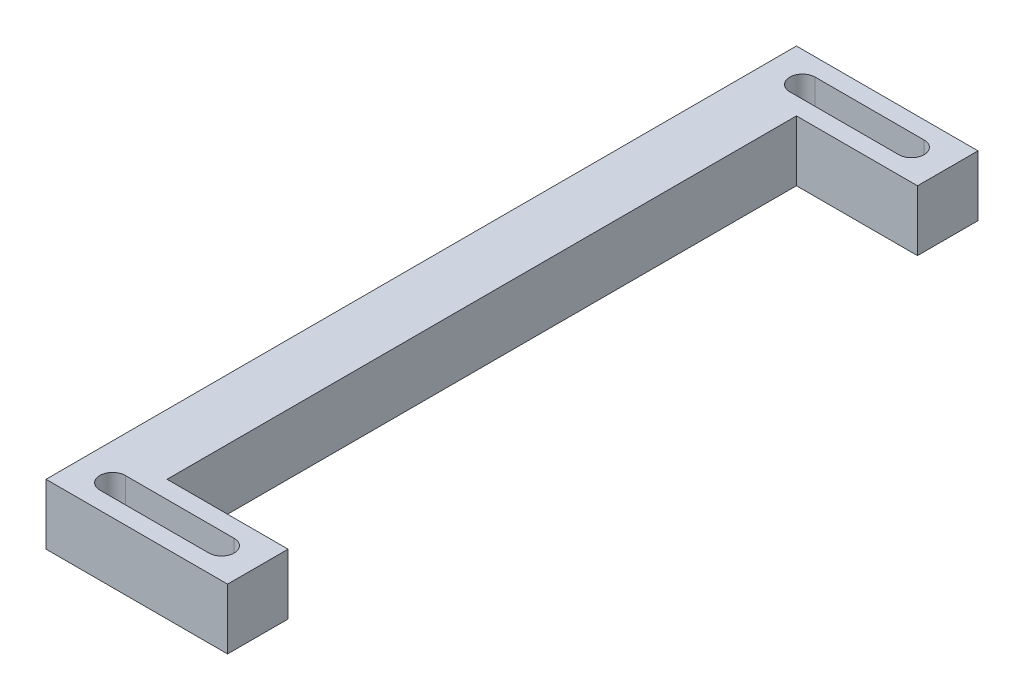
ISO-10303-21;
HEADER;
FILE_DESCRIPTION(('STEP AP214'),'2;1');
FILE_NAME('part.step','',(''),(''),'','','');
FILE_SCHEMA(('AUTOMOTIVE_DESIGN { 1 0 10303 214 1 1 1 1 }'));
ENDSEC;
DATA;
#1=APPLICATION_CONTEXT('core data for automotive mechanical design processes');
#2=APPLICATION_PROTOCOL_DEFINITION('international standard','automotive_design',2000,#1);
#3=PRODUCT_CONTEXT('',#1,'mechanical');
#4=PRODUCT('Part','Part','',(#3));
#5=PRODUCT_RELATED_PRODUCT_CATEGORY('part','',(#4));
#6=PRODUCT_DEFINITION_FORMATION('','',#4);
#7=PRODUCT_DEFINITION_CONTEXT('part definition',#1,'design');
#8=PRODUCT_DEFINITION('design','',#6,#7);
#9=PRODUCT_DEFINITION_SHAPE('','',#8);
#10=(LENGTH_UNIT() NAMED_UNIT(*) SI_UNIT(.MILLI.,.METRE.));
#11=(NAMED_UNIT(*) PLANE_ANGLE_UNIT() SI_UNIT($,.RADIAN.));
#12=(NAMED_UNIT(*) SI_UNIT($,.STERADIAN.) SOLID_ANGLE_UNIT());
#13=UNCERTAINTY_MEASURE_WITH_UNIT(LENGTH_MEASURE(1.E-05),#10,'distance_accuracy_value','');
#14=(GEOMETRIC_REPRESENTATION_CONTEXT(3) GLOBAL_UNCERTAINTY_ASSIGNED_CONTEXT((#13)) GLOBAL_UNIT_ASSIGNED_CONTEXT((#10,
#11,#12)) REPRESENTATION_CONTEXT('',''));
#15=CARTESIAN_POINT('',(0.,0.,0.));
#16=DIRECTION('',(0.,0.,1.));
#17=DIRECTION('',(1.,0.,0.));
#18=AXIS2_PLACEMENT_3D('',#15,#16,#17);
#19=CARTESIAN_POINT('',(0.,10.,0.));
#20=DIRECTION('',(0.,1.,0.));
#21=DIRECTION('',(0.,0.,1.));
#22=AXIS2_PLACEMENT_3D('',#19,#20,#21);
#23=PLANE('',#22);
#24=DIRECTION('',(1.,0.,0.));
#25=VECTOR('',#24,1.);
#26=CARTESIAN_POINT('',(-77.,10.,-52.));
#27=LINE('',#26,#25);
#28=CARTESIAN_POINT('',(-77.,10.,-52.));
#29=VERTEX_POINT('',#28);
#30=CARTESIAN_POINT('',(-57.,10.,-52.));
#31=VERTEX_POINT('',#30);
#32=EDGE_CURVE('E212',#29,#31,#27,.T.);
#33=ORIENTED_EDGE('',*,*,#32,.T.);
#34=DIRECTION('',(0.,0.,-1.));
#35=VECTOR('',#34,1.);
#36=CARTESIAN_POINT('',(-57.,10.,-52.));
#37=LINE('',#36,#35);
#38=CARTESIAN_POINT('',(-57.,10.,-62.));
#39=VERTEX_POINT('',#38);
#40=EDGE_CURVE('E215',#31,#39,#37,.T.);
#41=ORIENTED_EDGE('',*,*,#40,.T.);
#42=DIRECTION('',(-1.,0.,0.));
#43=VECTOR('',#42,1.);
#44=CARTESIAN_POINT('',(-57.,10.,-62.));
#45=LINE('',#44,#43);
#46=CARTESIAN_POINT('',(-87.,10.,-62.));
#47=VERTEX_POINT('',#46);
#48=EDGE_CURVE('E218',#39,#47,#45,.T.);
#49=ORIENTED_EDGE('',*,*,#48,.T.);
#50=DIRECTION('',(0.,0.,1.));
#51=VECTOR('',#50,1.);
#52=CARTESIAN_POINT('',(-87.,10.,-62.));
#53=LINE('',#52,#51);
#54=CARTESIAN_POINT('',(-87.,10.,62.));
#55=VERTEX_POINT('',#54);
#56=EDGE_CURVE('E220',#47,#55,#53,.T.);
#57=ORIENTED_EDGE('',*,*,#56,.T.);
#58=DIRECTION('',(1.,0.,0.));
#59=VECTOR('',#58,1.);
#60=CARTESIAN_POINT('',(-87.,10.,62.));
#61=LINE('',#60,#59);
#62=CARTESIAN_POINT('',(-57.,10.,62.));
#63=VERTEX_POINT('',#62);
#64=EDGE_CURVE('E222',#55,#63,#61,.T.);
#65=ORIENTED_EDGE('',*,*,#64,.T.);
#66=DIRECTION('',(0.,0.,-1.));
#67=VECTOR('',#66,1.);
#68=CARTESIAN_POINT('',(-57.,10.,62.));
#69=LINE('',#68,#67);
#70=CARTESIAN_POINT('',(-57.,10.,52.));
#71=VERTEX_POINT('',#70);
#72=EDGE_CURVE('E224',#63,#71,#69,.T.);
#73=ORIENTED_EDGE('',*,*,#72,.T.);
#74=DIRECTION('',(-1.,0.,0.));
#75=VECTOR('',#74,1.);
#76=CARTESIAN_POINT('',(-57.,10.,52.));
#77=LINE('',#76,#75);
#78=CARTESIAN_POINT('',(-77.,10.,52.));
#79=VERTEX_POINT('',#78);
#80=EDGE_CURVE('E226',#71,#79,#77,.T.);
#81=ORIENTED_EDGE('',*,*,#80,.T.);
#82=DIRECTION('',(0.,0.,-1.));
#83=VECTOR('',#82,1.);
#84=CARTESIAN_POINT('',(-77.,10.,52.));
#85=LINE('',#84,#83);
#86=EDGE_CURVE('E228',#79,#29,#85,.T.);
#87=ORIENTED_EDGE('',*,*,#86,.T.);
#88=EDGE_LOOP('',(#33,#41,#49,#57,#65,#73,#81,#87));
#89=FACE_BOUND('',#88,.T.);
#90=DIRECTION('',(1.,0.,0.));
#91=VECTOR('',#90,1.);
#92=CARTESIAN_POINT('',(-81.,10.,-54.9));
#93=LINE('',#92,#91);
#94=CARTESIAN_POINT('',(-81.,10.,-54.9));
#95=VERTEX_POINT('',#94);
#96=CARTESIAN_POINT('',(-63.0000000000001,10.,-54.9));
#97=VERTEX_POINT('',#96);
#98=EDGE_CURVE('E183',#95,#97,#93,.T.);
#99=ORIENTED_EDGE('',*,*,#98,.F.);
#100=CARTESIAN_POINT('',(-81.,10.,-57.));
#101=DIRECTION('',(0.,1.,0.));
#102=DIRECTION('',(0.,0.,1.));
#103=AXIS2_PLACEMENT_3D('',#100,#101,#102);
#104=CIRCLE('',#103,2.1);
#105=CARTESIAN_POINT('',(-81.,10.,-59.1));
#106=VERTEX_POINT('',#105);
#107=EDGE_CURVE('E181',#106,#95,#104,.T.);
#108=ORIENTED_EDGE('',*,*,#107,.F.);
#109=DIRECTION('',(-1.,0.,0.));
#110=VECTOR('',#109,1.);
#111=CARTESIAN_POINT('',(-81.,10.,-59.1));
#112=LINE('',#111,#110);
#113=CARTESIAN_POINT('',(-63.0000000000001,10.,-59.1));
#114=VERTEX_POINT('',#113);
#115=EDGE_CURVE('E189',#114,#106,#112,.T.);
#116=ORIENTED_EDGE('',*,*,#115,.F.);
#117=CARTESIAN_POINT('',(-63.0000000000001,10.,-57.));
#118=DIRECTION('',(0.,1.,0.));
#119=DIRECTION('',(0.,0.,1.));
#120=AXIS2_PLACEMENT_3D('',#117,#118,#119);
#121=CIRCLE('',#120,2.1);
#122=EDGE_CURVE('E186',#97,#114,#121,.T.);
#123=ORIENTED_EDGE('',*,*,#122,.F.);
#124=EDGE_LOOP('',(#99,#108,#116,#123));
#125=FACE_BOUND('',#124,.T.);
#126=DIRECTION('',(1.,0.,0.));
#127=VECTOR('',#126,1.);
#128=CARTESIAN_POINT('',(-81.,10.,59.1));
#129=LINE('',#128,#127);
#130=CARTESIAN_POINT('',(-81.,10.,59.1));
#131=VERTEX_POINT('',#130);
#132=CARTESIAN_POINT('',(-63.,10.,59.1));
#133=VERTEX_POINT('',#132);
#134=EDGE_CURVE('E153',#131,#133,#129,.T.);
#135=ORIENTED_EDGE('',*,*,#134,.F.);
#136=CARTESIAN_POINT('',(-81.,10.,57.));
#137=DIRECTION('',(0.,1.,0.));
#138=DIRECTION('',(0.,0.,-1.));
#139=AXIS2_PLACEMENT_3D('',#136,#137,#138);
#140=CIRCLE('',#139,2.1);
#141=CARTESIAN_POINT('',(-81.,10.,54.9));
#142=VERTEX_POINT('',#141);
#143=EDGE_CURVE('E145',#142,#131,#140,.T.);
#144=ORIENTED_EDGE('',*,*,#143,.F.);
#145=DIRECTION('',(-1.,0.,0.));
#146=VECTOR('',#145,1.);
#147=CARTESIAN_POINT('',(-81.,10.,54.9));
#148=LINE('',#147,#146);
#149=CARTESIAN_POINT('',(-63.0000000000001,10.,54.9));
#150=VERTEX_POINT('',#149);
#151=EDGE_CURVE('E167',#150,#142,#148,.T.);
#152=ORIENTED_EDGE('',*,*,#151,.F.);
#153=CARTESIAN_POINT('',(-63.,10.,57.));
#154=DIRECTION('',(0.,1.,0.));
#155=DIRECTION('',(0.,0.,-1.));
#156=AXIS2_PLACEMENT_3D('',#153,#154,#155);
#157=CIRCLE('',#156,2.1);
#158=EDGE_CURVE('E165',#133,#150,#157,.T.);
#159=ORIENTED_EDGE('',*,*,#158,.F.);
#160=EDGE_LOOP('',(#135,#144,#152,#159));
#161=FACE_BOUND('',#160,.T.);
#162=ADVANCED_FACE('F32',(#89,#125,#161),#23,.T.);
#163=CARTESIAN_POINT('',(0.,0.,0.));
#164=DIRECTION('',(0.,1.,0.));
#165=DIRECTION('',(0.,0.,1.));
#166=AXIS2_PLACEMENT_3D('',#163,#164,#165);
#167=PLANE('',#166);
#168=CARTESIAN_POINT('',(-81.,0.,-57.));
#169=DIRECTION('',(0.,1.,0.));
#170=DIRECTION('',(0.,0.,1.));
#171=AXIS2_PLACEMENT_3D('',#168,#169,#170);
#172=CIRCLE('',#171,2.1);
#173=CARTESIAN_POINT('',(-81.,0.,-59.1));
#174=VERTEX_POINT('',#173);
#175=CARTESIAN_POINT('',(-81.,0.,-54.9));
#176=VERTEX_POINT('',#175);
#177=EDGE_CURVE('E161',#174,#176,#172,.T.);
#178=ORIENTED_EDGE('',*,*,#177,.T.);
#179=DIRECTION('',(1.,0.,0.));
#180=VECTOR('',#179,1.);
#181=CARTESIAN_POINT('',(-81.,0.,-54.9));
#182=LINE('',#181,#180);
#183=CARTESIAN_POINT('',(-63.0000000000001,0.,-54.9));
#184=VERTEX_POINT('',#183);
#185=EDGE_CURVE('E194',#176,#184,#182,.T.);
#186=ORIENTED_EDGE('',*,*,#185,.T.);
#187=CARTESIAN_POINT('',(-63.0000000000001,0.,-57.));
#188=DIRECTION('',(0.,1.,0.));
#189=DIRECTION('',(0.,0.,1.));
#190=AXIS2_PLACEMENT_3D('',#187,#188,#189);
#191=CIRCLE('',#190,2.1);
#192=CARTESIAN_POINT('',(-63.0000000000001,0.,-59.1));
#193=VERTEX_POINT('',#192);
#194=EDGE_CURVE('E197',#184,#193,#191,.T.);
#195=ORIENTED_EDGE('',*,*,#194,.T.);
#196=DIRECTION('',(-1.,0.,0.));
#197=VECTOR('',#196,1.);
#198=CARTESIAN_POINT('',(-81.,0.,-59.1));
#199=LINE('',#198,#197);
#200=EDGE_CURVE('E184',#193,#174,#199,.T.);
#201=ORIENTED_EDGE('',*,*,#200,.T.);
#202=EDGE_LOOP('',(#178,#186,#195,#201));
#203=FACE_BOUND('',#202,.T.);
#204=DIRECTION('',(1.,0.,0.));
#205=VECTOR('',#204,1.);
#206=CARTESIAN_POINT('',(-77.,0.,-52.));
#207=LINE('',#206,#205);
#208=CARTESIAN_POINT('',(-77.,0.,-52.));
#209=VERTEX_POINT('',#208);
#210=CARTESIAN_POINT('',(-57.,0.,-52.));
#211=VERTEX_POINT('',#210);
#212=EDGE_CURVE('E211',#209,#211,#207,.T.);
#213=ORIENTED_EDGE('',*,*,#212,.F.);
#214=DIRECTION('',(0.,0.,-1.));
#215=VECTOR('',#214,1.);
#216=CARTESIAN_POINT('',(-77.,0.,52.));
#217=LINE('',#216,#215);
#218=CARTESIAN_POINT('',(-77.,0.,52.));
#219=VERTEX_POINT('',#218);
#220=EDGE_CURVE('E216',#219,#209,#217,.T.);
#221=ORIENTED_EDGE('',*,*,#220,.F.);
#222=DIRECTION('',(-1.,0.,0.));
#223=VECTOR('',#222,1.);
#224=CARTESIAN_POINT('',(-57.,0.,52.));
#225=LINE('',#224,#223);
#226=CARTESIAN_POINT('',(-57.,0.,52.));
#227=VERTEX_POINT('',#226);
#228=EDGE_CURVE('E243',#227,#219,#225,.T.);
#229=ORIENTED_EDGE('',*,*,#228,.F.);
#230=DIRECTION('',(0.,0.,-1.));
#231=VECTOR('',#230,1.);
#232=CARTESIAN_POINT('',(-57.,0.,62.));
#233=LINE('',#232,#231);
#234=CARTESIAN_POINT('',(-57.,0.,62.));
#235=VERTEX_POINT('',#234);
#236=EDGE_CURVE('E241',#235,#227,#233,.T.);
#237=ORIENTED_EDGE('',*,*,#236,.F.);
#238=DIRECTION('',(1.,0.,0.));
#239=VECTOR('',#238,1.);
#240=CARTESIAN_POINT('',(-87.,0.,62.));
#241=LINE('',#240,#239);
#242=CARTESIAN_POINT('',(-87.,0.,62.));
#243=VERTEX_POINT('',#242);
#244=EDGE_CURVE('E239',#243,#235,#241,.T.);
#245=ORIENTED_EDGE('',*,*,#244,.F.);
#246=DIRECTION('',(0.,0.,1.));
#247=VECTOR('',#246,1.);
#248=CARTESIAN_POINT('',(-87.,0.,-62.));
#249=LINE('',#248,#247);
#250=CARTESIAN_POINT('',(-87.,0.,-62.));
#251=VERTEX_POINT('',#250);
#252=EDGE_CURVE('E237',#251,#243,#249,.T.);
#253=ORIENTED_EDGE('',*,*,#252,.F.);
#254=DIRECTION('',(-1.,0.,0.));
#255=VECTOR('',#254,1.);
#256=CARTESIAN_POINT('',(-57.,0.,-62.));
#257=LINE('',#256,#255);
#258=CARTESIAN_POINT('',(-57.,0.,-62.));
#259=VERTEX_POINT('',#258);
#260=EDGE_CURVE('E235',#259,#251,#257,.T.);
#261=ORIENTED_EDGE('',*,*,#260,.F.);
#262=DIRECTION('',(0.,0.,-1.));
#263=VECTOR('',#262,1.);
#264=CARTESIAN_POINT('',(-57.,0.,-52.));
#265=LINE('',#264,#263);
#266=EDGE_CURVE('E233',#211,#259,#265,.T.);
#267=ORIENTED_EDGE('',*,*,#266,.F.);
#268=EDGE_LOOP('',(#213,#221,#229,#237,#245,#253,#261,#267));
#269=FACE_BOUND('',#268,.T.);
#270=CARTESIAN_POINT('',(-81.,0.,57.));
#271=DIRECTION('',(0.,1.,0.));
#272=DIRECTION('',(0.,0.,-1.));
#273=AXIS2_PLACEMENT_3D('',#270,#271,#272);
#274=CIRCLE('',#273,2.1);
#275=CARTESIAN_POINT('',(-81.,0.,54.9));
#276=VERTEX_POINT('',#275);
#277=CARTESIAN_POINT('',(-81.,0.,59.1));
#278=VERTEX_POINT('',#277);
#279=EDGE_CURVE('E55',#276,#278,#274,.T.);
#280=ORIENTED_EDGE('',*,*,#279,.T.);
#281=DIRECTION('',(1.,0.,0.));
#282=VECTOR('',#281,1.);
#283=CARTESIAN_POINT('',(-81.,0.,59.1));
#284=LINE('',#283,#282);
#285=CARTESIAN_POINT('',(-63.,0.,59.1));
#286=VERTEX_POINT('',#285);
#287=EDGE_CURVE('E160',#278,#286,#284,.T.);
#288=ORIENTED_EDGE('',*,*,#287,.T.);
#289=CARTESIAN_POINT('',(-63.,0.,57.));
#290=DIRECTION('',(0.,1.,0.));
#291=DIRECTION('',(0.,0.,-1.));
#292=AXIS2_PLACEMENT_3D('',#289,#290,#291);
#293=CIRCLE('',#292,2.1);
#294=CARTESIAN_POINT('',(-63.0000000000001,0.,54.9));
#295=VERTEX_POINT('',#294);
#296=EDGE_CURVE('E173',#286,#295,#293,.T.);
#297=ORIENTED_EDGE('',*,*,#296,.T.);
#298=DIRECTION('',(-1.,0.,0.));
#299=VECTOR('',#298,1.);
#300=CARTESIAN_POINT('',(-81.,0.,54.9));
#301=LINE('',#300,#299);
#302=EDGE_CURVE('E154',#295,#276,#301,.T.);
#303=ORIENTED_EDGE('',*,*,#302,.T.);
#304=EDGE_LOOP('',(#280,#288,#297,#303));
#305=FACE_BOUND('',#304,.T.);
#306=ADVANCED_FACE('F273',(#203,#269,#305),#167,.F.);
#307=CARTESIAN_POINT('',(-77.,10.,-52.));
#308=DIRECTION('',(0.,0.,-1.));
#309=DIRECTION('',(-1.,0.,0.));
#310=AXIS2_PLACEMENT_3D('',#307,#308,#309);
#311=PLANE('',#310);
#312=ORIENTED_EDGE('',*,*,#212,.T.);
#313=DIRECTION('',(0.,-1.,0.));
#314=VECTOR('',#313,1.);
#315=CARTESIAN_POINT('',(-57.,10.,-52.));
#316=LINE('',#315,#314);
#317=EDGE_CURVE('E11',#31,#211,#316,.T.);
#318=ORIENTED_EDGE('',*,*,#317,.F.);
#319=ORIENTED_EDGE('',*,*,#32,.F.);
#320=DIRECTION('',(0.,-1.,0.));
#321=VECTOR('',#320,1.);
#322=CARTESIAN_POINT('',(-77.,10.,-52.));
#323=LINE('',#322,#321);
#324=EDGE_CURVE('E230',#29,#209,#323,.T.);
#325=ORIENTED_EDGE('',*,*,#324,.T.);
#326=EDGE_LOOP('',(#312,#318,#319,#325));
#327=FACE_BOUND('',#326,.T.);
#328=ADVANCED_FACE('F34',(#327),#311,.F.);
#329=CARTESIAN_POINT('',(-57.,10.,-52.));
#330=DIRECTION('',(-1.,0.,0.));
#331=DIRECTION('',(0.,0.,1.));
#332=AXIS2_PLACEMENT_3D('',#329,#330,#331);
#333=PLANE('',#332);
#334=ORIENTED_EDGE('',*,*,#266,.T.);
#335=DIRECTION('',(0.,-1.,0.));
#336=VECTOR('',#335,1.);
#337=CARTESIAN_POINT('',(-57.,10.,-62.));
#338=LINE('',#337,#336);
#339=EDGE_CURVE('E40',#39,#259,#338,.T.);
#340=ORIENTED_EDGE('',*,*,#339,.F.);
#341=ORIENTED_EDGE('',*,*,#40,.F.);
#342=ORIENTED_EDGE('',*,*,#317,.T.);
#343=EDGE_LOOP('',(#334,#340,#341,#342));
#344=FACE_BOUND('',#343,.T.);
#345=ADVANCED_FACE('F291',(#344),#333,.F.);
#346=CARTESIAN_POINT('',(-57.,10.,-62.));
#347=DIRECTION('',(0.,0.,1.));
#348=DIRECTION('',(1.,0.,0.));
#349=AXIS2_PLACEMENT_3D('',#346,#347,#348);
#350=PLANE('',#349);
#351=ORIENTED_EDGE('',*,*,#260,.T.);
#352=DIRECTION('',(0.,-1.,0.));
#353=VECTOR('',#352,1.);
#354=CARTESIAN_POINT('',(-87.,10.,-62.));
#355=LINE('',#354,#353);
#356=EDGE_CURVE('E260',#47,#251,#355,.T.);
#357=ORIENTED_EDGE('',*,*,#356,.F.);
#358=ORIENTED_EDGE('',*,*,#48,.F.);
#359=ORIENTED_EDGE('',*,*,#339,.T.);
#360=EDGE_LOOP('',(#351,#357,#358,#359));
#361=FACE_BOUND('',#360,.T.);
#362=ADVANCED_FACE('F267',(#361),#350,.F.);
#363=CARTESIAN_POINT('',(-87.,10.,-62.));
#364=DIRECTION('',(1.,0.,0.));
#365=DIRECTION('',(0.,0.,-1.));
#366=AXIS2_PLACEMENT_3D('',#363,#364,#365);
#367=PLANE('',#366);
#368=ORIENTED_EDGE('',*,*,#252,.T.);
#369=DIRECTION('',(0.,-1.,0.));
#370=VECTOR('',#369,1.);
#371=CARTESIAN_POINT('',(-87.,10.,62.));
#372=LINE('',#371,#370);
#373=EDGE_CURVE('E257',#55,#243,#372,.T.);
#374=ORIENTED_EDGE('',*,*,#373,.F.);
#375=ORIENTED_EDGE('',*,*,#56,.F.);
#376=ORIENTED_EDGE('',*,*,#356,.T.);
#377=EDGE_LOOP('',(#368,#374,#375,#376));
#378=FACE_BOUND('',#377,.T.);
#379=ADVANCED_FACE('F279',(#378),#367,.F.);
#380=CARTESIAN_POINT('',(-87.,10.,62.));
#381=DIRECTION('',(0.,0.,-1.));
#382=DIRECTION('',(-1.,0.,0.));
#383=AXIS2_PLACEMENT_3D('',#380,#381,#382);
#384=PLANE('',#383);
#385=ORIENTED_EDGE('',*,*,#244,.T.);
#386=DIRECTION('',(0.,-1.,0.));
#387=VECTOR('',#386,1.);
#388=CARTESIAN_POINT('',(-57.,10.,62.));
#389=LINE('',#388,#387);
#390=EDGE_CURVE('E254',#63,#235,#389,.T.);
#391=ORIENTED_EDGE('',*,*,#390,.F.);
#392=ORIENTED_EDGE('',*,*,#64,.F.);
#393=ORIENTED_EDGE('',*,*,#373,.T.);
#394=EDGE_LOOP('',(#385,#391,#392,#393));
#395=FACE_BOUND('',#394,.T.);
#396=ADVANCED_FACE('F283',(#395),#384,.F.);
#397=CARTESIAN_POINT('',(-57.,10.,62.));
#398=DIRECTION('',(-1.,0.,0.));
#399=DIRECTION('',(0.,0.,1.));
#400=AXIS2_PLACEMENT_3D('',#397,#398,#399);
#401=PLANE('',#400);
#402=ORIENTED_EDGE('',*,*,#236,.T.);
#403=DIRECTION('',(0.,-1.,0.));
#404=VECTOR('',#403,1.);
#405=CARTESIAN_POINT('',(-57.,10.,52.));
#406=LINE('',#405,#404);
#407=EDGE_CURVE('E251',#71,#227,#406,.T.);
#408=ORIENTED_EDGE('',*,*,#407,.F.);
#409=ORIENTED_EDGE('',*,*,#72,.F.);
#410=ORIENTED_EDGE('',*,*,#390,.T.);
#411=EDGE_LOOP('',(#402,#408,#409,#410));
#412=FACE_BOUND('',#411,.T.);
#413=ADVANCED_FACE('F304',(#412),#401,.F.);
#414=CARTESIAN_POINT('',(-57.,10.,52.));
#415=DIRECTION('',(0.,0.,1.));
#416=DIRECTION('',(1.,0.,0.));
#417=AXIS2_PLACEMENT_3D('',#414,#415,#416);
#418=PLANE('',#417);
#419=ORIENTED_EDGE('',*,*,#228,.T.);
#420=DIRECTION('',(0.,-1.,0.));
#421=VECTOR('',#420,1.);
#422=CARTESIAN_POINT('',(-77.,10.,52.));
#423=LINE('',#422,#421);
#424=EDGE_CURVE('E248',#79,#219,#423,.T.);
#425=ORIENTED_EDGE('',*,*,#424,.F.);
#426=ORIENTED_EDGE('',*,*,#80,.F.);
#427=ORIENTED_EDGE('',*,*,#407,.T.);
#428=EDGE_LOOP('',(#419,#425,#426,#427));
#429=FACE_BOUND('',#428,.T.);
#430=ADVANCED_FACE('F302',(#429),#418,.F.);
#431=CARTESIAN_POINT('',(-77.,10.,52.));
#432=DIRECTION('',(-1.,0.,0.));
#433=DIRECTION('',(0.,0.,1.));
#434=AXIS2_PLACEMENT_3D('',#431,#432,#433);
#435=PLANE('',#434);
#436=ORIENTED_EDGE('',*,*,#220,.T.);
#437=ORIENTED_EDGE('',*,*,#324,.F.);
#438=ORIENTED_EDGE('',*,*,#86,.F.);
#439=ORIENTED_EDGE('',*,*,#424,.T.);
#440=EDGE_LOOP('',(#436,#437,#438,#439));
#441=FACE_BOUND('',#440,.T.);
#442=ADVANCED_FACE('F297',(#441),#435,.F.);
#443=CARTESIAN_POINT('',(-81.,10.,-57.));
#444=DIRECTION('',(0.,-1.,0.));
#445=DIRECTION('',(0.,0.,-1.));
#446=AXIS2_PLACEMENT_3D('',#443,#444,#445);
#447=CYLINDRICAL_SURFACE('',#446,2.1);
#448=ORIENTED_EDGE('',*,*,#177,.F.);
#449=DIRECTION('',(0.,-1.,0.));
#450=VECTOR('',#449,1.);
#451=CARTESIAN_POINT('',(-81.,10.,-59.1));
#452=LINE('',#451,#450);
#453=EDGE_CURVE('E191',#106,#174,#452,.T.);
#454=ORIENTED_EDGE('',*,*,#453,.F.);
#455=ORIENTED_EDGE('',*,*,#107,.T.);
#456=DIRECTION('',(0.,-1.,0.));
#457=VECTOR('',#456,1.);
#458=CARTESIAN_POINT('',(-81.,10.,-54.9));
#459=LINE('',#458,#457);
#460=EDGE_CURVE('E208',#95,#176,#459,.T.);
#461=ORIENTED_EDGE('',*,*,#460,.T.);
#462=EDGE_LOOP('',(#448,#454,#455,#461));
#463=FACE_BOUND('',#462,.T.);
#464=ADVANCED_FACE('F321',(#463),#447,.F.);
#465=CARTESIAN_POINT('',(-81.,10.,-54.9));
#466=DIRECTION('',(0.,0.,-1.));
#467=DIRECTION('',(-1.,0.,0.));
#468=AXIS2_PLACEMENT_3D('',#465,#466,#467);
#469=PLANE('',#468);
#470=ORIENTED_EDGE('',*,*,#185,.F.);
#471=ORIENTED_EDGE('',*,*,#460,.F.);
#472=ORIENTED_EDGE('',*,*,#98,.T.);
#473=DIRECTION('',(0.,-1.,0.));
#474=VECTOR('',#473,1.);
#475=CARTESIAN_POINT('',(-63.0000000000001,10.,-54.9));
#476=LINE('',#475,#474);
#477=EDGE_CURVE('E206',#97,#184,#476,.T.);
#478=ORIENTED_EDGE('',*,*,#477,.T.);
#479=EDGE_LOOP('',(#470,#471,#472,#478));
#480=FACE_BOUND('',#479,.T.);
#481=ADVANCED_FACE('F328',(#480),#469,.T.);
#482=CARTESIAN_POINT('',(-63.0000000000001,10.,-57.));
#483=DIRECTION('',(0.,-1.,0.));
#484=DIRECTION('',(0.,0.,-1.));
#485=AXIS2_PLACEMENT_3D('',#482,#483,#484);
#486=CYLINDRICAL_SURFACE('',#485,2.1);
#487=ORIENTED_EDGE('',*,*,#194,.F.);
#488=ORIENTED_EDGE('',*,*,#477,.F.);
#489=ORIENTED_EDGE('',*,*,#122,.T.);
#490=DIRECTION('',(0.,-1.,0.));
#491=VECTOR('',#490,1.);
#492=CARTESIAN_POINT('',(-63.0000000000001,10.,-59.1));
#493=LINE('',#492,#491);
#494=EDGE_CURVE('E204',#114,#193,#493,.T.);
#495=ORIENTED_EDGE('',*,*,#494,.T.);
#496=EDGE_LOOP('',(#487,#488,#489,#495));
#497=FACE_BOUND('',#496,.T.);
#498=ADVANCED_FACE('F333',(#497),#486,.F.);
#499=CARTESIAN_POINT('',(-81.,10.,-59.1));
#500=DIRECTION('',(0.,0.,1.));
#501=DIRECTION('',(1.,0.,0.));
#502=AXIS2_PLACEMENT_3D('',#499,#500,#501);
#503=PLANE('',#502);
#504=ORIENTED_EDGE('',*,*,#200,.F.);
#505=ORIENTED_EDGE('',*,*,#494,.F.);
#506=ORIENTED_EDGE('',*,*,#115,.T.);
#507=ORIENTED_EDGE('',*,*,#453,.T.);
#508=EDGE_LOOP('',(#504,#505,#506,#507));
#509=FACE_BOUND('',#508,.T.);
#510=ADVANCED_FACE('F340',(#509),#503,.T.);
#511=CARTESIAN_POINT('',(-81.,10.,57.));
#512=DIRECTION('',(0.,-1.,0.));
#513=DIRECTION('',(0.,0.,-1.));
#514=AXIS2_PLACEMENT_3D('',#511,#512,#513);
#515=CYLINDRICAL_SURFACE('',#514,2.1);
#516=ORIENTED_EDGE('',*,*,#279,.F.);
#517=DIRECTION('',(0.,-1.,0.));
#518=VECTOR('',#517,1.);
#519=CARTESIAN_POINT('',(-81.,10.,54.9));
#520=LINE('',#519,#518);
#521=EDGE_CURVE('E149',#142,#276,#520,.T.);
#522=ORIENTED_EDGE('',*,*,#521,.F.);
#523=ORIENTED_EDGE('',*,*,#143,.T.);
#524=DIRECTION('',(0.,-1.,0.));
#525=VECTOR('',#524,1.);
#526=CARTESIAN_POINT('',(-81.,10.,59.1));
#527=LINE('',#526,#525);
#528=EDGE_CURVE('E148',#131,#278,#527,.T.);
#529=ORIENTED_EDGE('',*,*,#528,.T.);
#530=EDGE_LOOP('',(#516,#522,#523,#529));
#531=FACE_BOUND('',#530,.T.);
#532=ADVANCED_FACE('F147',(#531),#515,.F.);
#533=CARTESIAN_POINT('',(-81.,10.,59.1));
#534=DIRECTION('',(0.,0.,-1.));
#535=DIRECTION('',(-1.,0.,0.));
#536=AXIS2_PLACEMENT_3D('',#533,#534,#535);
#537=PLANE('',#536);
#538=ORIENTED_EDGE('',*,*,#287,.F.);
#539=ORIENTED_EDGE('',*,*,#528,.F.);
#540=ORIENTED_EDGE('',*,*,#134,.T.);
#541=DIRECTION('',(0.,-1.,0.));
#542=VECTOR('',#541,1.);
#543=CARTESIAN_POINT('',(-63.,10.,59.1));
#544=LINE('',#543,#542);
#545=EDGE_CURVE('E162',#133,#286,#544,.T.);
#546=ORIENTED_EDGE('',*,*,#545,.T.);
#547=EDGE_LOOP('',(#538,#539,#540,#546));
#548=FACE_BOUND('',#547,.T.);
#549=ADVANCED_FACE('F157',(#548),#537,.T.);
#550=CARTESIAN_POINT('',(-63.,10.,57.));
#551=DIRECTION('',(0.,-1.,0.));
#552=DIRECTION('',(0.,0.,-1.));
#553=AXIS2_PLACEMENT_3D('',#550,#551,#552);
#554=CYLINDRICAL_SURFACE('',#553,2.1);
#555=ORIENTED_EDGE('',*,*,#296,.F.);
#556=ORIENTED_EDGE('',*,*,#545,.F.);
#557=ORIENTED_EDGE('',*,*,#158,.T.);
#558=DIRECTION('',(0.,-1.,0.));
#559=VECTOR('',#558,1.);
#560=CARTESIAN_POINT('',(-63.0000000000001,10.,54.9));
#561=LINE('',#560,#559);
#562=EDGE_CURVE('E47',#150,#295,#561,.T.);
#563=ORIENTED_EDGE('',*,*,#562,.T.);
#564=EDGE_LOOP('',(#555,#556,#557,#563));
#565=FACE_BOUND('',#564,.T.);
#566=ADVANCED_FACE('F358',(#565),#554,.F.);
#567=CARTESIAN_POINT('',(-81.,10.,54.9));
#568=DIRECTION('',(0.,0.,1.));
#569=DIRECTION('',(1.,0.,0.));
#570=AXIS2_PLACEMENT_3D('',#567,#568,#569);
#571=PLANE('',#570);
#572=ORIENTED_EDGE('',*,*,#302,.F.);
#573=ORIENTED_EDGE('',*,*,#562,.F.);
#574=ORIENTED_EDGE('',*,*,#151,.T.);
#575=ORIENTED_EDGE('',*,*,#521,.T.);
#576=EDGE_LOOP('',(#572,#573,#574,#575));
#577=FACE_BOUND('',#576,.T.);
#578=ADVANCED_FACE('F361',(#577),#571,.T.);
#579=CLOSED_SHELL('',(#162,#306,#328,#345,#362,#379,#396,#413,#430,#442,#464,#481,#498,#510,
#532,#549,#566,#578));
#580=MANIFOLD_SOLID_BREP('B2',#579);
#581=ADVANCED_BREP_SHAPE_REPRESENTATION('',(#18,#580),#14);
#582=SHAPE_DEFINITION_REPRESENTATION(#9,#581);
ENDSEC;
END-ISO-10303-21;
